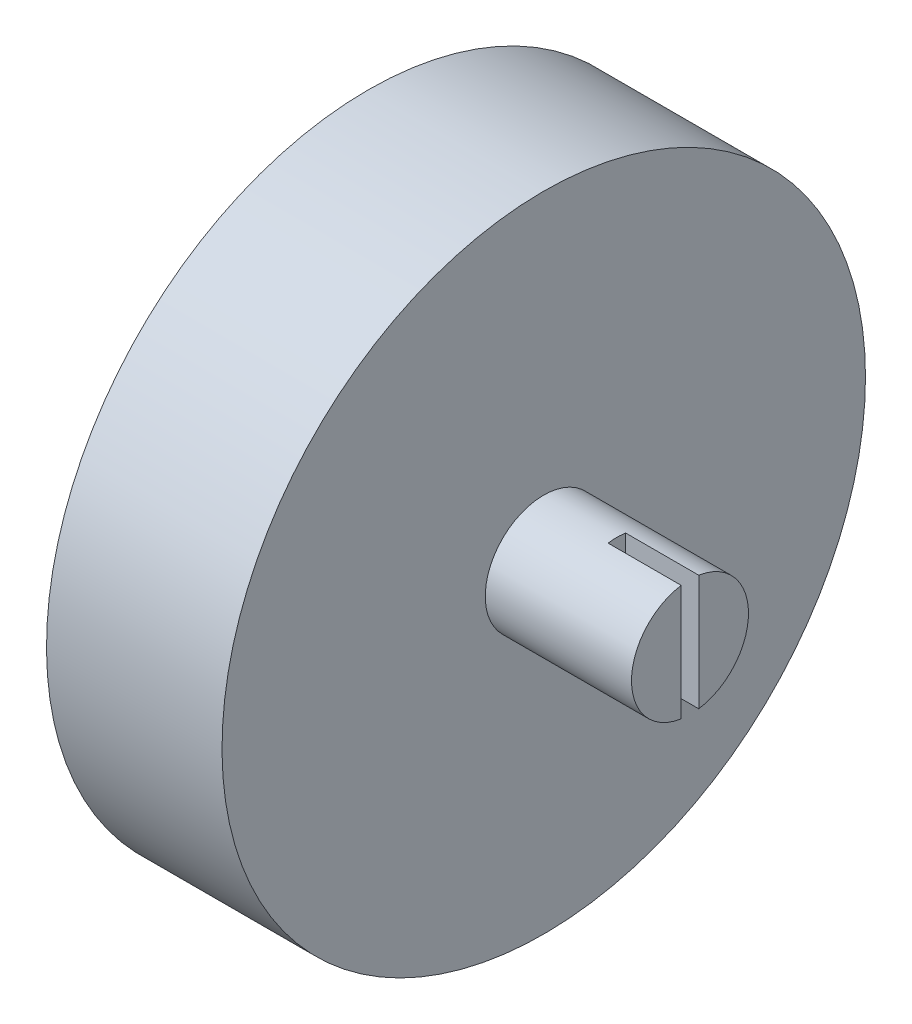
ISO-10303-21;
HEADER;
FILE_DESCRIPTION(('STEP AP214'),'2;1');
FILE_NAME('part.step','',(''),(''),'','','');
FILE_SCHEMA(('AUTOMOTIVE_DESIGN { 1 0 10303 214 1 1 1 1 }'));
ENDSEC;
DATA;
#1=APPLICATION_CONTEXT('core data for automotive mechanical design processes');
#2=APPLICATION_PROTOCOL_DEFINITION('international standard','automotive_design',2000,#1);
#3=PRODUCT_CONTEXT('',#1,'mechanical');
#4=PRODUCT('Part','Part','',(#3));
#5=PRODUCT_RELATED_PRODUCT_CATEGORY('part','',(#4));
#6=PRODUCT_DEFINITION_FORMATION('','',#4);
#7=PRODUCT_DEFINITION_CONTEXT('part definition',#1,'design');
#8=PRODUCT_DEFINITION('design','',#6,#7);
#9=PRODUCT_DEFINITION_SHAPE('','',#8);
#10=(LENGTH_UNIT() NAMED_UNIT(*) SI_UNIT(.MILLI.,.METRE.));
#11=(NAMED_UNIT(*) PLANE_ANGLE_UNIT() SI_UNIT($,.RADIAN.));
#12=(NAMED_UNIT(*) SI_UNIT($,.STERADIAN.) SOLID_ANGLE_UNIT());
#13=UNCERTAINTY_MEASURE_WITH_UNIT(LENGTH_MEASURE(1.E-05),#10,'distance_accuracy_value','');
#14=(GEOMETRIC_REPRESENTATION_CONTEXT(3) GLOBAL_UNCERTAINTY_ASSIGNED_CONTEXT((#13)) GLOBAL_UNIT_ASSIGNED_CONTEXT((#10,
#11,#12)) REPRESENTATION_CONTEXT('',''));
#15=CARTESIAN_POINT('',(0.,0.,0.));
#16=DIRECTION('',(0.,0.,1.));
#17=DIRECTION('',(1.,0.,0.));
#18=AXIS2_PLACEMENT_3D('',#15,#16,#17);
#19=CARTESIAN_POINT('',(5.5,19.5568517413347,6.50000000000001));
#20=DIRECTION('',(0.,0.,-1.));
#21=DIRECTION('',(0.,1.,0.));
#22=AXIS2_PLACEMENT_3D('',#19,#20,#21);
#23=PLANE('',#22);
#24=DIRECTION('',(-1.,0.,0.));
#25=VECTOR('',#24,1.);
#26=CARTESIAN_POINT('',(5.5,-6.94314825866529,6.5));
#27=LINE('',#26,#25);
#28=CARTESIAN_POINT('',(5.5,-6.94314825866529,6.5));
#29=VERTEX_POINT('',#28);
#30=CARTESIAN_POINT('',(4.25,-6.94314825866529,6.5));
#31=VERTEX_POINT('',#30);
#32=EDGE_CURVE('E466',#29,#31,#27,.T.);
#33=ORIENTED_EDGE('',*,*,#32,.T.);
#34=DIRECTION('',(0.,-1.,0.));
#35=VECTOR('',#34,1.);
#36=CARTESIAN_POINT('',(4.25,-5.94314825866529,6.5));
#37=LINE('',#36,#35);
#38=CARTESIAN_POINT('',(4.25,-5.94314825866529,6.5));
#39=VERTEX_POINT('',#38);
#40=EDGE_CURVE('E55',#39,#31,#37,.T.);
#41=ORIENTED_EDGE('',*,*,#40,.F.);
#42=DIRECTION('',(1.,0.,0.));
#43=VECTOR('',#42,1.);
#44=CARTESIAN_POINT('',(0.,-5.94314825866529,6.5));
#45=LINE('',#44,#43);
#46=CARTESIAN_POINT('',(3.,-5.94314825866529,6.5));
#47=VERTEX_POINT('',#46);
#48=EDGE_CURVE('E246',#47,#39,#45,.T.);
#49=ORIENTED_EDGE('',*,*,#48,.F.);
#50=DIRECTION('',(0.,1.,0.));
#51=VECTOR('',#50,1.);
#52=CARTESIAN_POINT('',(3.,19.5568517413347,6.50000000000001));
#53=LINE('',#52,#51);
#54=CARTESIAN_POINT('',(3.,17.1748906632346,6.50000000000001));
#55=VERTEX_POINT('',#54);
#56=EDGE_CURVE('E367',#47,#55,#53,.T.);
#57=ORIENTED_EDGE('',*,*,#56,.T.);
#58=DIRECTION('',(1.,0.,0.));
#59=VECTOR('',#58,1.);
#60=CARTESIAN_POINT('',(5.5,17.1748906632346,6.50000000000001));
#61=LINE('',#60,#59);
#62=CARTESIAN_POINT('',(0.,17.1748906632346,6.5));
#63=VERTEX_POINT('',#62);
#64=EDGE_CURVE('E380',#63,#55,#61,.T.);
#65=ORIENTED_EDGE('',*,*,#64,.F.);
#66=DIRECTION('',(0.,-1.,0.));
#67=VECTOR('',#66,1.);
#68=CARTESIAN_POINT('',(0.,19.5568517413347,6.50000000000001));
#69=LINE('',#68,#67);
#70=CARTESIAN_POINT('',(0.,19.5568517413347,6.50000000000001));
#71=VERTEX_POINT('',#70);
#72=EDGE_CURVE('E390',#71,#63,#69,.T.);
#73=ORIENTED_EDGE('',*,*,#72,.F.);
#74=DIRECTION('',(-1.,0.,0.));
#75=VECTOR('',#74,1.);
#76=CARTESIAN_POINT('',(5.5,19.5568517413347,6.50000000000001));
#77=LINE('',#76,#75);
#78=CARTESIAN_POINT('',(5.5,19.5568517413347,6.50000000000001));
#79=VERTEX_POINT('',#78);
#80=EDGE_CURVE('E462',#79,#71,#77,.T.);
#81=ORIENTED_EDGE('',*,*,#80,.F.);
#82=DIRECTION('',(0.,-1.,0.));
#83=VECTOR('',#82,1.);
#84=CARTESIAN_POINT('',(5.5,19.5568517413347,6.50000000000001));
#85=LINE('',#84,#83);
#86=EDGE_CURVE('E423',#79,#29,#85,.T.);
#87=ORIENTED_EDGE('',*,*,#86,.T.);
#88=EDGE_LOOP('',(#33,#41,#49,#57,#65,#73,#81,#87));
#89=FACE_BOUND('',#88,.T.);
#90=ADVANCED_FACE('F39',(#89),#23,.T.);
#91=CARTESIAN_POINT('',(5.5,-6.94314825866529,6.5));
#92=DIRECTION('',(0.,1.,0.));
#93=DIRECTION('',(0.,0.,1.));
#94=AXIS2_PLACEMENT_3D('',#91,#92,#93);
#95=PLANE('',#94);
#96=DIRECTION('',(0.,0.,1.));
#97=VECTOR('',#96,1.);
#98=CARTESIAN_POINT('',(3.,-6.9431482586653,9.00000000000001));
#99=LINE('',#98,#97);
#100=CARTESIAN_POINT('',(3.,-6.9431482586653,6.5));
#101=VERTEX_POINT('',#100);
#102=CARTESIAN_POINT('',(3.,-6.9431482586653,9.00000000000001));
#103=VERTEX_POINT('',#102);
#104=EDGE_CURVE('E336',#101,#103,#99,.T.);
#105=ORIENTED_EDGE('',*,*,#104,.F.);
#106=DIRECTION('',(1.,0.,0.));
#107=VECTOR('',#106,1.);
#108=CARTESIAN_POINT('',(0.,-6.94314825866529,6.5));
#109=LINE('',#108,#107);
#110=CARTESIAN_POINT('',(0.,-6.94314825866529,6.5));
#111=VERTEX_POINT('',#110);
#112=EDGE_CURVE('E693',#111,#101,#109,.T.);
#113=ORIENTED_EDGE('',*,*,#112,.F.);
#114=DIRECTION('',(0.,0.,-1.));
#115=VECTOR('',#114,1.);
#116=CARTESIAN_POINT('',(0.,-6.94314825866529,6.5));
#117=LINE('',#116,#115);
#118=CARTESIAN_POINT('',(0.,-6.9431482586653,9.00000000000001));
#119=VERTEX_POINT('',#118);
#120=EDGE_CURVE('E262',#119,#111,#117,.T.);
#121=ORIENTED_EDGE('',*,*,#120,.F.);
#122=DIRECTION('',(-1.,0.,0.));
#123=VECTOR('',#122,1.);
#124=CARTESIAN_POINT('',(3.,-6.9431482586653,9.00000000000001));
#125=LINE('',#124,#123);
#126=EDGE_CURVE('E371',#103,#119,#125,.T.);
#127=ORIENTED_EDGE('',*,*,#126,.F.);
#128=EDGE_LOOP('',(#105,#113,#121,#127));
#129=FACE_BOUND('',#128,.T.);
#130=ADVANCED_FACE('F628',(#129),#95,.T.);
#131=DIRECTION('',(-1.,0.,0.));
#132=VECTOR('',#131,1.);
#133=CARTESIAN_POINT('',(5.5,-6.94314825866529,4.76239289224447));
#134=LINE('',#133,#132);
#135=CARTESIAN_POINT('',(5.5,-6.94314825866529,4.76239289224447));
#136=VERTEX_POINT('',#135);
#137=CARTESIAN_POINT('',(4.25,-6.94314825866529,4.76239289224447));
#138=VERTEX_POINT('',#137);
#139=EDGE_CURVE('E469',#136,#138,#134,.T.);
#140=ORIENTED_EDGE('',*,*,#139,.T.);
#141=DIRECTION('',(0.,0.,-1.));
#142=VECTOR('',#141,1.);
#143=CARTESIAN_POINT('',(4.25,-6.94314825866529,4.76239289224447));
#144=LINE('',#143,#142);
#145=EDGE_CURVE('E63',#31,#138,#144,.T.);
#146=ORIENTED_EDGE('',*,*,#145,.F.);
#147=ORIENTED_EDGE('',*,*,#32,.F.);
#148=DIRECTION('',(0.,0.,-1.));
#149=VECTOR('',#148,1.);
#150=CARTESIAN_POINT('',(5.5,-6.94314825866529,6.5));
#151=LINE('',#150,#149);
#152=EDGE_CURVE('E420',#29,#136,#151,.T.);
#153=ORIENTED_EDGE('',*,*,#152,.T.);
#154=EDGE_LOOP('',(#140,#146,#147,#153));
#155=FACE_BOUND('',#154,.T.);
#156=ADVANCED_FACE('F633',(#155),#95,.T.);
#157=CARTESIAN_POINT('',(5.5,-6.94314825866529,-6.5));
#158=DIRECTION('',(0.,-1.,0.));
#159=DIRECTION('',(0.,0.,-1.));
#160=AXIS2_PLACEMENT_3D('',#157,#158,#159);
#161=PLANE('',#160);
#162=DIRECTION('',(0.,0.,-1.));
#163=VECTOR('',#162,1.);
#164=CARTESIAN_POINT('',(4.,-6.94314825866529,-6.51239289224447));
#165=LINE('',#164,#163);
#166=CARTESIAN_POINT('',(4.,-6.94314825866529,-4.76239289224447));
#167=VERTEX_POINT('',#166);
#168=CARTESIAN_POINT('',(4.,-6.94314825866529,-6.5));
#169=VERTEX_POINT('',#168);
#170=EDGE_CURVE('E264',#167,#169,#165,.T.);
#171=ORIENTED_EDGE('',*,*,#170,.F.);
#172=DIRECTION('',(-1.,0.,0.));
#173=VECTOR('',#172,1.);
#174=CARTESIAN_POINT('',(5.5,-6.94314825866529,-4.76239289224447));
#175=LINE('',#174,#173);
#176=CARTESIAN_POINT('',(5.5,-6.94314825866529,-4.76239289224447));
#177=VERTEX_POINT('',#176);
#178=EDGE_CURVE('E491',#177,#167,#175,.T.);
#179=ORIENTED_EDGE('',*,*,#178,.F.);
#180=DIRECTION('',(0.,0.,1.));
#181=VECTOR('',#180,1.);
#182=CARTESIAN_POINT('',(5.5,-6.94314825866529,-6.5));
#183=LINE('',#182,#181);
#184=CARTESIAN_POINT('',(5.5,-6.94314825866529,-6.5));
#185=VERTEX_POINT('',#184);
#186=EDGE_CURVE('E394',#185,#177,#183,.T.);
#187=ORIENTED_EDGE('',*,*,#186,.F.);
#188=DIRECTION('',(-1.,0.,0.));
#189=VECTOR('',#188,1.);
#190=CARTESIAN_POINT('',(5.5,-6.94314825866529,-6.5));
#191=LINE('',#190,#189);
#192=EDGE_CURVE('E495',#185,#169,#191,.T.);
#193=ORIENTED_EDGE('',*,*,#192,.T.);
#194=EDGE_LOOP('',(#171,#179,#187,#193));
#195=FACE_BOUND('',#194,.T.);
#196=ADVANCED_FACE('F563',(#195),#161,.F.);
#197=DIRECTION('',(-1.,0.,0.));
#198=VECTOR('',#197,1.);
#199=CARTESIAN_POINT('',(0.,-6.94314825866529,-6.51239289224447));
#200=LINE('',#199,#198);
#201=CARTESIAN_POINT('',(3.,-6.94314825866529,-6.51239289224447));
#202=VERTEX_POINT('',#201);
#203=CARTESIAN_POINT('',(0.,-6.94314825866529,-6.51239289224447));
#204=VERTEX_POINT('',#203);
#205=EDGE_CURVE('E268',#202,#204,#200,.T.);
#206=ORIENTED_EDGE('',*,*,#205,.F.);
#207=CARTESIAN_POINT('',(3.,-6.9431482586653,-9.));
#208=VERTEX_POINT('',#207);
#209=EDGE_CURVE('E338',#208,#202,#99,.T.);
#210=ORIENTED_EDGE('',*,*,#209,.F.);
#211=DIRECTION('',(-1.,0.,0.));
#212=VECTOR('',#211,1.);
#213=CARTESIAN_POINT('',(3.,-6.9431482586653,-9.));
#214=LINE('',#213,#212);
#215=CARTESIAN_POINT('',(0.,-6.9431482586653,-9.));
#216=VERTEX_POINT('',#215);
#217=EDGE_CURVE('E351',#208,#216,#214,.T.);
#218=ORIENTED_EDGE('',*,*,#217,.T.);
#219=DIRECTION('',(0.,0.,1.));
#220=VECTOR('',#219,1.);
#221=CARTESIAN_POINT('',(0.,-6.94314825866529,-6.5));
#222=LINE('',#221,#220);
#223=EDGE_CURVE('E433',#216,#204,#222,.T.);
#224=ORIENTED_EDGE('',*,*,#223,.T.);
#225=EDGE_LOOP('',(#206,#210,#218,#224));
#226=FACE_BOUND('',#225,.T.);
#227=ADVANCED_FACE('F545',(#226),#161,.F.);
#228=CARTESIAN_POINT('',(5.5,19.5568517413347,-6.49999999999999));
#229=DIRECTION('',(0.,0.,-1.));
#230=DIRECTION('',(0.,1.,0.));
#231=AXIS2_PLACEMENT_3D('',#228,#229,#230);
#232=PLANE('',#231);
#233=DIRECTION('',(0.,1.,0.));
#234=VECTOR('',#233,1.);
#235=CARTESIAN_POINT('',(4.,19.5568517413347,-6.49999999999999));
#236=LINE('',#235,#234);
#237=CARTESIAN_POINT('',(4.,-5.94314825866529,-6.5));
#238=VERTEX_POINT('',#237);
#239=EDGE_CURVE('E11',#169,#238,#236,.T.);
#240=ORIENTED_EDGE('',*,*,#239,.F.);
#241=ORIENTED_EDGE('',*,*,#192,.F.);
#242=DIRECTION('',(0.,-1.,0.));
#243=VECTOR('',#242,1.);
#244=CARTESIAN_POINT('',(5.5,19.5568517413347,-6.49999999999999));
#245=LINE('',#244,#243);
#246=CARTESIAN_POINT('',(5.5,19.5568517413347,-6.49999999999999));
#247=VERTEX_POINT('',#246);
#248=EDGE_CURVE('E389',#247,#185,#245,.T.);
#249=ORIENTED_EDGE('',*,*,#248,.F.);
#250=DIRECTION('',(-1.,0.,0.));
#251=VECTOR('',#250,1.);
#252=CARTESIAN_POINT('',(5.5,19.5568517413347,-6.49999999999999));
#253=LINE('',#252,#251);
#254=CARTESIAN_POINT('',(0.,19.5568517413347,-6.49999999999999));
#255=VERTEX_POINT('',#254);
#256=EDGE_CURVE('E426',#247,#255,#253,.T.);
#257=ORIENTED_EDGE('',*,*,#256,.T.);
#258=DIRECTION('',(0.,-1.,0.));
#259=VECTOR('',#258,1.);
#260=CARTESIAN_POINT('',(0.,19.5568517413347,-6.49999999999999));
#261=LINE('',#260,#259);
#262=CARTESIAN_POINT('',(0.,17.1748906632345,-6.5));
#263=VERTEX_POINT('',#262);
#264=EDGE_CURVE('E429',#255,#263,#261,.T.);
#265=ORIENTED_EDGE('',*,*,#264,.T.);
#266=DIRECTION('',(1.,0.,0.));
#267=VECTOR('',#266,1.);
#268=CARTESIAN_POINT('',(5.5,17.1748906632345,-6.49999999999999));
#269=LINE('',#268,#267);
#270=CARTESIAN_POINT('',(3.,17.1748906632345,-6.5));
#271=VERTEX_POINT('',#270);
#272=EDGE_CURVE('E331',#263,#271,#269,.T.);
#273=ORIENTED_EDGE('',*,*,#272,.T.);
#274=DIRECTION('',(0.,1.,0.));
#275=VECTOR('',#274,1.);
#276=CARTESIAN_POINT('',(3.,19.5568517413347,-6.49999999999999));
#277=LINE('',#276,#275);
#278=CARTESIAN_POINT('',(3.,-5.94314825866529,-6.5));
#279=VERTEX_POINT('',#278);
#280=EDGE_CURVE('E512',#279,#271,#277,.T.);
#281=ORIENTED_EDGE('',*,*,#280,.F.);
#282=DIRECTION('',(-1.,0.,0.));
#283=VECTOR('',#282,1.);
#284=CARTESIAN_POINT('',(5.5,-5.94314825866529,-6.5));
#285=LINE('',#284,#283);
#286=EDGE_CURVE('E298',#238,#279,#285,.T.);
#287=ORIENTED_EDGE('',*,*,#286,.F.);
#288=EDGE_LOOP('',(#240,#241,#249,#257,#265,#273,#281,#287));
#289=FACE_BOUND('',#288,.T.);
#290=ADVANCED_FACE('F567',(#289),#232,.F.);
#291=CARTESIAN_POINT('',(3.,0.,0.));
#292=DIRECTION('',(-1.,0.,0.));
#293=DIRECTION('',(0.,0.,1.));
#294=AXIS2_PLACEMENT_3D('',#291,#292,#293);
#295=PLANE('',#294);
#296=ORIENTED_EDGE('',*,*,#209,.T.);
#297=DIRECTION('',(0.,1.,0.));
#298=VECTOR('',#297,1.);
#299=CARTESIAN_POINT('',(3.,0.,-6.51239289224447));
#300=LINE('',#299,#298);
#301=CARTESIAN_POINT('',(3.,-5.94314825866529,-6.51239289224447));
#302=VERTEX_POINT('',#301);
#303=EDGE_CURVE('E48',#202,#302,#300,.T.);
#304=ORIENTED_EDGE('',*,*,#303,.T.);
#305=DIRECTION('',(0.,0.,1.));
#306=VECTOR('',#305,1.);
#307=CARTESIAN_POINT('',(3.,-5.94314825866529,0.));
#308=LINE('',#307,#306);
#309=EDGE_CURVE('E530',#302,#279,#308,.T.);
#310=ORIENTED_EDGE('',*,*,#309,.T.);
#311=ORIENTED_EDGE('',*,*,#280,.T.);
#312=DIRECTION('',(0.,0.,-1.));
#313=VECTOR('',#312,1.);
#314=CARTESIAN_POINT('',(3.,17.1748906632346,9.));
#315=LINE('',#314,#313);
#316=CARTESIAN_POINT('',(3.,17.1748906632345,-9.00000000000001));
#317=VERTEX_POINT('',#316);
#318=EDGE_CURVE('E346',#271,#317,#315,.T.);
#319=ORIENTED_EDGE('',*,*,#318,.T.);
#320=DIRECTION('',(0.,-1.,0.));
#321=VECTOR('',#320,1.);
#322=CARTESIAN_POINT('',(3.,-6.9431482586653,-9.));
#323=LINE('',#322,#321);
#324=EDGE_CURVE('E332',#317,#208,#323,.T.);
#325=ORIENTED_EDGE('',*,*,#324,.T.);
#326=EDGE_LOOP('',(#296,#304,#310,#311,#319,#325));
#327=FACE_BOUND('',#326,.T.);
#328=ADVANCED_FACE('F536',(#327),#295,.T.);
#329=CARTESIAN_POINT('',(22.,0.,0.));
#330=DIRECTION('',(-1.,0.,0.));
#331=DIRECTION('',(0.,0.,1.));
#332=AXIS2_PLACEMENT_3D('',#329,#330,#331);
#333=CYLINDRICAL_SURFACE('',#332,4.);
#334=CARTESIAN_POINT('',(12.,0.,0.));
#335=DIRECTION('',(1.,0.,0.));
#336=DIRECTION('',(0.,0.,-1.));
#337=AXIS2_PLACEMENT_3D('',#334,#335,#336);
#338=CIRCLE('',#337,4.);
#339=CARTESIAN_POINT('',(12.,0.,-4.));
#340=VERTEX_POINT('',#339);
#341=EDGE_CURVE('E326',#340,#340,#338,.T.);
#342=ORIENTED_EDGE('',*,*,#341,.T.);
#343=EDGE_LOOP('',(#342));
#344=FACE_BOUND('',#343,.T.);
#345=DIRECTION('',(-1.,0.,0.));
#346=VECTOR('',#345,1.);
#347=CARTESIAN_POINT('',(22.,3.95474398665704,-0.6));
#348=LINE('',#347,#346);
#349=CARTESIAN_POINT('',(22.,3.95474398665704,-0.6));
#350=VERTEX_POINT('',#349);
#351=CARTESIAN_POINT('',(17.,3.95474398665704,-0.6));
#352=VERTEX_POINT('',#351);
#353=EDGE_CURVE('E318',#350,#352,#348,.T.);
#354=ORIENTED_EDGE('',*,*,#353,.F.);
#355=CARTESIAN_POINT('',(22.,0.,0.));
#356=DIRECTION('',(1.,0.,0.));
#357=DIRECTION('',(0.,0.,-1.));
#358=AXIS2_PLACEMENT_3D('',#355,#356,#357);
#359=CIRCLE('',#358,4.);
#360=CARTESIAN_POINT('',(22.,-3.95474398665704,-0.6));
#361=VERTEX_POINT('',#360);
#362=EDGE_CURVE('E321',#361,#350,#359,.T.);
#363=ORIENTED_EDGE('',*,*,#362,.F.);
#364=DIRECTION('',(-1.,0.,0.));
#365=VECTOR('',#364,1.);
#366=CARTESIAN_POINT('',(22.,-3.95474398665704,-0.6));
#367=LINE('',#366,#365);
#368=CARTESIAN_POINT('',(17.,-3.95474398665704,-0.6));
#369=VERTEX_POINT('',#368);
#370=EDGE_CURVE('E315',#369,#361,#367,.F.);
#371=ORIENTED_EDGE('',*,*,#370,.F.);
#372=CARTESIAN_POINT('',(17.,0.,0.));
#373=DIRECTION('',(-1.,0.,0.));
#374=DIRECTION('',(0.,0.,1.));
#375=AXIS2_PLACEMENT_3D('',#372,#373,#374);
#376=CIRCLE('',#375,4.);
#377=CARTESIAN_POINT('',(17.,-3.95474398665704,0.6));
#378=VERTEX_POINT('',#377);
#379=EDGE_CURVE('E525',#369,#378,#376,.T.);
#380=ORIENTED_EDGE('',*,*,#379,.T.);
#381=DIRECTION('',(-1.,0.,0.));
#382=VECTOR('',#381,1.);
#383=CARTESIAN_POINT('',(22.,-3.95474398665704,0.6));
#384=LINE('',#383,#382);
#385=CARTESIAN_POINT('',(22.,-3.95474398665704,0.6));
#386=VERTEX_POINT('',#385);
#387=EDGE_CURVE('E312',#386,#378,#384,.T.);
#388=ORIENTED_EDGE('',*,*,#387,.F.);
#389=CARTESIAN_POINT('',(22.,3.95474398665704,0.600000000000001));
#390=VERTEX_POINT('',#389);
#391=EDGE_CURVE('E325',#390,#386,#359,.T.);
#392=ORIENTED_EDGE('',*,*,#391,.F.);
#393=DIRECTION('',(-1.,0.,0.));
#394=VECTOR('',#393,1.);
#395=CARTESIAN_POINT('',(22.,3.95474398665704,0.600000000000001));
#396=LINE('',#395,#394);
#397=CARTESIAN_POINT('',(17.,3.95474398665704,0.600000000000001));
#398=VERTEX_POINT('',#397);
#399=EDGE_CURVE('E309',#398,#390,#396,.F.);
#400=ORIENTED_EDGE('',*,*,#399,.F.);
#401=EDGE_CURVE('E529',#398,#352,#376,.T.);
#402=ORIENTED_EDGE('',*,*,#401,.T.);
#403=EDGE_LOOP('',(#354,#363,#371,#380,#388,#392,#400,#402));
#404=FACE_BOUND('',#403,.T.);
#405=ADVANCED_FACE('F586',(#344,#404),#333,.T.);
#406=CARTESIAN_POINT('',(22.,0.,0.));
#407=DIRECTION('',(1.,0.,0.));
#408=DIRECTION('',(0.,0.,-1.));
#409=AXIS2_PLACEMENT_3D('',#406,#407,#408);
#410=PLANE('',#409);
#411=ORIENTED_EDGE('',*,*,#362,.T.);
#412=DIRECTION('',(0.,-1.,0.));
#413=VECTOR('',#412,1.);
#414=CARTESIAN_POINT('',(22.,0.,-0.6));
#415=LINE('',#414,#413);
#416=EDGE_CURVE('E521',#350,#361,#415,.T.);
#417=ORIENTED_EDGE('',*,*,#416,.T.);
#418=EDGE_LOOP('',(#411,#417));
#419=FACE_BOUND('',#418,.T.);
#420=ADVANCED_FACE('F752',(#419),#410,.T.);
#421=ORIENTED_EDGE('',*,*,#391,.T.);
#422=DIRECTION('',(0.,1.,0.));
#423=VECTOR('',#422,1.);
#424=CARTESIAN_POINT('',(22.,0.,0.6));
#425=LINE('',#424,#423);
#426=EDGE_CURVE('E330',#386,#390,#425,.T.);
#427=ORIENTED_EDGE('',*,*,#426,.T.);
#428=EDGE_LOOP('',(#421,#427));
#429=FACE_BOUND('',#428,.T.);
#430=ADVANCED_FACE('F581',(#429),#410,.T.);
#431=CARTESIAN_POINT('',(12.,0.,0.));
#432=DIRECTION('',(-1.,0.,0.));
#433=DIRECTION('',(0.,0.,1.));
#434=AXIS2_PLACEMENT_3D('',#431,#432,#433);
#435=CYLINDRICAL_SURFACE('',#434,22.);
#436=CARTESIAN_POINT('',(0.,0.,0.));
#437=DIRECTION('',(1.,0.,0.));
#438=DIRECTION('',(0.,0.,-1.));
#439=AXIS2_PLACEMENT_3D('',#436,#437,#438);
#440=CIRCLE('',#439,22.);
#441=CARTESIAN_POINT('',(0.,-21.837327130716,-2.67042015160433));
#442=VERTEX_POINT('',#441);
#443=CARTESIAN_POINT('',(0.,-21.837327130716,2.67042015160434));
#444=VERTEX_POINT('',#443);
#445=EDGE_CURVE('E465',#442,#444,#440,.T.);
#446=ORIENTED_EDGE('',*,*,#445,.T.);
#447=DIRECTION('',(-1.,0.,0.));
#448=VECTOR('',#447,1.);
#449=CARTESIAN_POINT('',(5.5,-21.837327130716,2.67042015160434));
#450=LINE('',#449,#448);
#451=CARTESIAN_POINT('',(5.5,-21.837327130716,2.67042015160434));
#452=VERTEX_POINT('',#451);
#453=EDGE_CURVE('E478',#452,#444,#450,.T.);
#454=ORIENTED_EDGE('',*,*,#453,.F.);
#455=CARTESIAN_POINT('',(5.5,0.,0.));
#456=DIRECTION('',(1.,0.,0.));
#457=DIRECTION('',(0.,0.,-1.));
#458=AXIS2_PLACEMENT_3D('',#455,#456,#457);
#459=CIRCLE('',#458,22.);
#460=CARTESIAN_POINT('',(5.5,-21.837327130716,-2.67042015160433));
#461=VERTEX_POINT('',#460);
#462=EDGE_CURVE('E506',#452,#461,#459,.T.);
#463=ORIENTED_EDGE('',*,*,#462,.T.);
#464=DIRECTION('',(-1.,0.,0.));
#465=VECTOR('',#464,1.);
#466=CARTESIAN_POINT('',(5.5,-21.837327130716,-2.67042015160433));
#467=LINE('',#466,#465);
#468=EDGE_CURVE('E481',#461,#442,#467,.T.);
#469=ORIENTED_EDGE('',*,*,#468,.T.);
#470=EDGE_LOOP('',(#446,#454,#463,#469));
#471=FACE_BOUND('',#470,.T.);
#472=CARTESIAN_POINT('',(12.,0.,0.));
#473=DIRECTION('',(1.,0.,0.));
#474=DIRECTION('',(0.,0.,-1.));
#475=AXIS2_PLACEMENT_3D('',#472,#473,#474);
#476=CIRCLE('',#475,22.);
#477=CARTESIAN_POINT('',(12.,0.,-22.));
#478=VERTEX_POINT('',#477);
#479=EDGE_CURVE('E502',#478,#478,#476,.T.);
#480=ORIENTED_EDGE('',*,*,#479,.F.);
#481=EDGE_LOOP('',(#480));
#482=FACE_BOUND('',#481,.T.);
#483=ADVANCED_FACE('F41',(#471,#482),#435,.T.);
#484=CARTESIAN_POINT('',(12.,0.,0.));
#485=DIRECTION('',(1.,0.,0.));
#486=DIRECTION('',(0.,0.,-1.));
#487=AXIS2_PLACEMENT_3D('',#484,#485,#486);
#488=PLANE('',#487);
#489=ORIENTED_EDGE('',*,*,#341,.F.);
#490=EDGE_LOOP('',(#489));
#491=FACE_BOUND('',#490,.T.);
#492=ORIENTED_EDGE('',*,*,#479,.T.);
#493=EDGE_LOOP('',(#492));
#494=FACE_BOUND('',#493,.T.);
#495=ADVANCED_FACE('F665',(#491,#494),#488,.T.);
#496=CARTESIAN_POINT('',(0.,0.,0.));
#497=DIRECTION('',(1.,0.,0.));
#498=DIRECTION('',(0.,0.,-1.));
#499=AXIS2_PLACEMENT_3D('',#496,#497,#498);
#500=PLANE('',#499);
#501=CARTESIAN_POINT('',(0.,0.,14.));
#502=DIRECTION('',(1.,0.,0.));
#503=DIRECTION('',(0.,0.,-1.));
#504=AXIS2_PLACEMENT_3D('',#501,#502,#503);
#505=CIRCLE('',#504,1.5);
#506=CARTESIAN_POINT('',(0.,0.,12.5));
#507=VERTEX_POINT('',#506);
#508=EDGE_CURVE('E676',#507,#507,#505,.T.);
#509=ORIENTED_EDGE('',*,*,#508,.T.);
#510=EDGE_LOOP('',(#509));
#511=FACE_BOUND('',#510,.T.);
#512=CARTESIAN_POINT('',(0.,0.,-14.));
#513=DIRECTION('',(1.,0.,0.));
#514=DIRECTION('',(0.,0.,-1.));
#515=AXIS2_PLACEMENT_3D('',#512,#513,#514);
#516=CIRCLE('',#515,1.5);
#517=CARTESIAN_POINT('',(0.,0.,-15.5));
#518=VERTEX_POINT('',#517);
#519=EDGE_CURVE('E679',#518,#518,#516,.T.);
#520=ORIENTED_EDGE('',*,*,#519,.T.);
#521=EDGE_LOOP('',(#520));
#522=FACE_BOUND('',#521,.T.);
#523=ORIENTED_EDGE('',*,*,#72,.T.);
#524=DIRECTION('',(0.,0.,-1.));
#525=VECTOR('',#524,1.);
#526=CARTESIAN_POINT('',(0.,17.1748906632346,9.));
#527=LINE('',#526,#525);
#528=CARTESIAN_POINT('',(0.,17.1748906632346,9.));
#529=VERTEX_POINT('',#528);
#530=EDGE_CURVE('E337',#529,#63,#527,.T.);
#531=ORIENTED_EDGE('',*,*,#530,.F.);
#532=DIRECTION('',(0.,1.,0.));
#533=VECTOR('',#532,1.);
#534=CARTESIAN_POINT('',(0.,17.1748906632346,9.));
#535=LINE('',#534,#533);
#536=EDGE_CURVE('E356',#119,#529,#535,.T.);
#537=ORIENTED_EDGE('',*,*,#536,.F.);
#538=ORIENTED_EDGE('',*,*,#120,.T.);
#539=DIRECTION('',(0.,-1.,0.));
#540=VECTOR('',#539,1.);
#541=CARTESIAN_POINT('',(0.,-5.94314825866529,6.5));
#542=LINE('',#541,#540);
#543=CARTESIAN_POINT('',(0.,-5.94314825866529,6.5));
#544=VERTEX_POINT('',#543);
#545=EDGE_CURVE('E241',#544,#111,#542,.T.);
#546=ORIENTED_EDGE('',*,*,#545,.F.);
#547=DIRECTION('',(0.,0.,1.));
#548=VECTOR('',#547,1.);
#549=CARTESIAN_POINT('',(0.,-5.94314825866529,4.76239289224447));
#550=LINE('',#549,#548);
#551=CARTESIAN_POINT('',(0.,-5.94314825866529,4.76239289224447));
#552=VERTEX_POINT('',#551);
#553=EDGE_CURVE('E250',#552,#544,#550,.T.);
#554=ORIENTED_EDGE('',*,*,#553,.F.);
#555=DIRECTION('',(0.,1.,0.));
#556=VECTOR('',#555,1.);
#557=CARTESIAN_POINT('',(0.,-10.,4.76239289224447));
#558=LINE('',#557,#556);
#559=CARTESIAN_POINT('',(0.,-10.,4.76239289224447));
#560=VERTEX_POINT('',#559);
#561=EDGE_CURVE('E455',#560,#552,#558,.T.);
#562=ORIENTED_EDGE('',*,*,#561,.F.);
#563=DIRECTION('',(0.,-0.952328688194239,-0.305073875712489));
#564=VECTOR('',#563,1.);
#565=CARTESIAN_POINT('',(0.,-10.,4.76239289224447));
#566=LINE('',#565,#564);
#567=CARTESIAN_POINT('',(0.,-16.5303712131336,2.67042015160433));
#568=VERTEX_POINT('',#567);
#569=EDGE_CURVE('E451',#560,#568,#566,.T.);
#570=ORIENTED_EDGE('',*,*,#569,.T.);
#571=DIRECTION('',(0.,1.,0.));
#572=VECTOR('',#571,1.);
#573=CARTESIAN_POINT('',(0.,-16.8581606699215,2.67042015160433));
#574=LINE('',#573,#572);
#575=EDGE_CURVE('E447',#444,#568,#574,.T.);
#576=ORIENTED_EDGE('',*,*,#575,.F.);
#577=ORIENTED_EDGE('',*,*,#445,.F.);
#578=DIRECTION('',(0.,-1.,0.));
#579=VECTOR('',#578,1.);
#580=CARTESIAN_POINT('',(0.,-16.8581606699215,-2.67042015160433));
#581=LINE('',#580,#579);
#582=CARTESIAN_POINT('',(0.,-16.5303712131336,-2.67042015160434));
#583=VERTEX_POINT('',#582);
#584=EDGE_CURVE('E444',#583,#442,#581,.T.);
#585=ORIENTED_EDGE('',*,*,#584,.F.);
#586=DIRECTION('',(0.,-0.95232868819424,0.305073875712488));
#587=VECTOR('',#586,1.);
#588=CARTESIAN_POINT('',(0.,-10.,-4.76239289224447));
#589=LINE('',#588,#587);
#590=CARTESIAN_POINT('',(0.,-10.,-4.76239289224447));
#591=VERTEX_POINT('',#590);
#592=EDGE_CURVE('E440',#591,#583,#589,.T.);
#593=ORIENTED_EDGE('',*,*,#592,.F.);
#594=DIRECTION('',(0.,1.,0.));
#595=VECTOR('',#594,1.);
#596=CARTESIAN_POINT('',(0.,-10.,-4.76239289224447));
#597=LINE('',#596,#595);
#598=CARTESIAN_POINT('',(0.,-5.94314825866529,-4.76239289224447));
#599=VERTEX_POINT('',#598);
#600=EDGE_CURVE('E437',#591,#599,#597,.T.);
#601=ORIENTED_EDGE('',*,*,#600,.T.);
#602=DIRECTION('',(0.,0.,1.));
#603=VECTOR('',#602,1.);
#604=CARTESIAN_POINT('',(0.,-5.94314825866529,-4.76239289224447));
#605=LINE('',#604,#603);
#606=CARTESIAN_POINT('',(0.,-5.94314825866529,-6.51239289224447));
#607=VERTEX_POINT('',#606);
#608=EDGE_CURVE('E285',#607,#599,#605,.T.);
#609=ORIENTED_EDGE('',*,*,#608,.F.);
#610=DIRECTION('',(0.,-1.,0.));
#611=VECTOR('',#610,1.);
#612=CARTESIAN_POINT('',(0.,-5.94314825866529,-6.51239289224447));
#613=LINE('',#612,#611);
#614=EDGE_CURVE('E288',#607,#204,#613,.T.);
#615=ORIENTED_EDGE('',*,*,#614,.T.);
#616=ORIENTED_EDGE('',*,*,#223,.F.);
#617=DIRECTION('',(0.,-1.,0.));
#618=VECTOR('',#617,1.);
#619=CARTESIAN_POINT('',(0.,-6.9431482586653,-9.));
#620=LINE('',#619,#618);
#621=CARTESIAN_POINT('',(0.,17.1748906632345,-9.00000000000001));
#622=VERTEX_POINT('',#621);
#623=EDGE_CURVE('E352',#622,#216,#620,.T.);
#624=ORIENTED_EDGE('',*,*,#623,.F.);
#625=EDGE_CURVE('E360',#263,#622,#527,.T.);
#626=ORIENTED_EDGE('',*,*,#625,.F.);
#627=ORIENTED_EDGE('',*,*,#264,.F.);
#628=DIRECTION('',(0.,0.,-1.));
#629=VECTOR('',#628,1.);
#630=CARTESIAN_POINT('',(0.,19.5568517413347,6.50000000000001));
#631=LINE('',#630,#629);
#632=EDGE_CURVE('E384',#71,#255,#631,.T.);
#633=ORIENTED_EDGE('',*,*,#632,.F.);
#634=EDGE_LOOP('',(#523,#531,#537,#538,#546,#554,#562,#570,#576,#577,#585,#593,#601,#609,#615,
#616,#624,#626,#627,#633));
#635=FACE_BOUND('',#634,.T.);
#636=ADVANCED_FACE('F260',(#511,#522,#635),#500,.F.);
#637=CARTESIAN_POINT('',(5.5,0.,0.));
#638=DIRECTION('',(1.,0.,0.));
#639=DIRECTION('',(0.,0.,-1.));
#640=AXIS2_PLACEMENT_3D('',#637,#638,#639);
#641=PLANE('',#640);
#642=ORIENTED_EDGE('',*,*,#462,.F.);
#643=DIRECTION('',(0.,-1.,0.));
#644=VECTOR('',#643,1.);
#645=CARTESIAN_POINT('',(5.5,-16.8581606699215,2.67042015160433));
#646=LINE('',#645,#644);
#647=CARTESIAN_POINT('',(5.5,-16.5303712131336,2.67042015160433));
#648=VERTEX_POINT('',#647);
#649=EDGE_CURVE('E408',#648,#452,#646,.T.);
#650=ORIENTED_EDGE('',*,*,#649,.F.);
#651=DIRECTION('',(0.,-0.952328688194239,-0.305073875712489));
#652=VECTOR('',#651,1.);
#653=CARTESIAN_POINT('',(5.5,-10.,4.76239289224447));
#654=LINE('',#653,#652);
#655=CARTESIAN_POINT('',(5.5,-10.,4.76239289224447));
#656=VERTEX_POINT('',#655);
#657=EDGE_CURVE('E412',#656,#648,#654,.T.);
#658=ORIENTED_EDGE('',*,*,#657,.F.);
#659=DIRECTION('',(0.,1.,0.));
#660=VECTOR('',#659,1.);
#661=CARTESIAN_POINT('',(5.5,-10.,4.76239289224447));
#662=LINE('',#661,#660);
#663=EDGE_CURVE('E416',#656,#136,#662,.T.);
#664=ORIENTED_EDGE('',*,*,#663,.T.);
#665=ORIENTED_EDGE('',*,*,#152,.F.);
#666=ORIENTED_EDGE('',*,*,#86,.F.);
#667=DIRECTION('',(0.,0.,-1.));
#668=VECTOR('',#667,1.);
#669=CARTESIAN_POINT('',(5.5,19.5568517413347,6.50000000000001));
#670=LINE('',#669,#668);
#671=EDGE_CURVE('E385',#79,#247,#670,.T.);
#672=ORIENTED_EDGE('',*,*,#671,.T.);
#673=ORIENTED_EDGE('',*,*,#248,.T.);
#674=ORIENTED_EDGE('',*,*,#186,.T.);
#675=DIRECTION('',(0.,1.,0.));
#676=VECTOR('',#675,1.);
#677=CARTESIAN_POINT('',(5.5,-10.,-4.76239289224447));
#678=LINE('',#677,#676);
#679=CARTESIAN_POINT('',(5.5,-10.,-4.76239289224447));
#680=VERTEX_POINT('',#679);
#681=EDGE_CURVE('E398',#680,#177,#678,.T.);
#682=ORIENTED_EDGE('',*,*,#681,.F.);
#683=DIRECTION('',(0.,-0.95232868819424,0.305073875712488));
#684=VECTOR('',#683,1.);
#685=CARTESIAN_POINT('',(5.5,-10.,-4.76239289224447));
#686=LINE('',#685,#684);
#687=CARTESIAN_POINT('',(5.5,-16.5303712131336,-2.67042015160434));
#688=VERTEX_POINT('',#687);
#689=EDGE_CURVE('E401',#680,#688,#686,.T.);
#690=ORIENTED_EDGE('',*,*,#689,.T.);
#691=DIRECTION('',(0.,1.,0.));
#692=VECTOR('',#691,1.);
#693=CARTESIAN_POINT('',(5.5,-16.8581606699215,-2.67042015160433));
#694=LINE('',#693,#692);
#695=EDGE_CURVE('E405',#461,#688,#694,.T.);
#696=ORIENTED_EDGE('',*,*,#695,.F.);
#697=EDGE_LOOP('',(#642,#650,#658,#664,#665,#666,#672,#673,#674,#682,#690,#696));
#698=FACE_BOUND('',#697,.T.);
#699=ADVANCED_FACE('F613',(#698),#641,.F.);
#700=CARTESIAN_POINT('',(5.5,19.5568517413347,6.50000000000001));
#701=DIRECTION('',(0.,1.,0.));
#702=DIRECTION('',(0.,0.,1.));
#703=AXIS2_PLACEMENT_3D('',#700,#701,#702);
#704=PLANE('',#703);
#705=ORIENTED_EDGE('',*,*,#632,.T.);
#706=ORIENTED_EDGE('',*,*,#256,.F.);
#707=ORIENTED_EDGE('',*,*,#671,.F.);
#708=ORIENTED_EDGE('',*,*,#80,.T.);
#709=EDGE_LOOP('',(#705,#706,#707,#708));
#710=FACE_BOUND('',#709,.T.);
#711=ADVANCED_FACE('F614',(#710),#704,.F.);
#712=CARTESIAN_POINT('',(5.5,-10.,4.76239289224447));
#713=DIRECTION('',(0.,0.,1.));
#714=DIRECTION('',(1.,0.,0.));
#715=AXIS2_PLACEMENT_3D('',#712,#713,#714);
#716=PLANE('',#715);
#717=ORIENTED_EDGE('',*,*,#561,.T.);
#718=DIRECTION('',(-1.,0.,0.));
#719=VECTOR('',#718,1.);
#720=CARTESIAN_POINT('',(0.,-5.94314825866529,4.76239289224447));
#721=LINE('',#720,#719);
#722=CARTESIAN_POINT('',(4.25,-5.94314825866529,4.76239289224447));
#723=VERTEX_POINT('',#722);
#724=EDGE_CURVE('E253',#723,#552,#721,.T.);
#725=ORIENTED_EDGE('',*,*,#724,.F.);
#726=DIRECTION('',(0.,-1.,0.));
#727=VECTOR('',#726,1.);
#728=CARTESIAN_POINT('',(4.25,-5.94314825866529,4.76239289224447));
#729=LINE('',#728,#727);
#730=EDGE_CURVE('E270',#723,#138,#729,.T.);
#731=ORIENTED_EDGE('',*,*,#730,.T.);
#732=ORIENTED_EDGE('',*,*,#139,.F.);
#733=ORIENTED_EDGE('',*,*,#663,.F.);
#734=DIRECTION('',(-1.,0.,0.));
#735=VECTOR('',#734,1.);
#736=CARTESIAN_POINT('',(5.5,-10.,4.76239289224447));
#737=LINE('',#736,#735);
#738=EDGE_CURVE('E472',#656,#560,#737,.T.);
#739=ORIENTED_EDGE('',*,*,#738,.T.);
#740=EDGE_LOOP('',(#717,#725,#731,#732,#733,#739));
#741=FACE_BOUND('',#740,.T.);
#742=ADVANCED_FACE('F637',(#741),#716,.F.);
#743=CARTESIAN_POINT('',(5.5,-10.,4.76239289224447));
#744=DIRECTION('',(0.,0.305073875712489,-0.952328688194239));
#745=DIRECTION('',(0.,0.952328688194239,0.305073875712489));
#746=AXIS2_PLACEMENT_3D('',#743,#744,#745);
#747=PLANE('',#746);
#748=ORIENTED_EDGE('',*,*,#569,.F.);
#749=ORIENTED_EDGE('',*,*,#738,.F.);
#750=ORIENTED_EDGE('',*,*,#657,.T.);
#751=DIRECTION('',(-1.,0.,0.));
#752=VECTOR('',#751,1.);
#753=CARTESIAN_POINT('',(5.5,-16.5303712131336,2.67042015160433));
#754=LINE('',#753,#752);
#755=EDGE_CURVE('E475',#648,#568,#754,.T.);
#756=ORIENTED_EDGE('',*,*,#755,.T.);
#757=EDGE_LOOP('',(#748,#749,#750,#756));
#758=FACE_BOUND('',#757,.T.);
#759=ADVANCED_FACE('F640',(#758),#747,.T.);
#760=CARTESIAN_POINT('',(5.5,-16.8581606699215,2.67042015160433));
#761=DIRECTION('',(0.,0.,1.));
#762=DIRECTION('',(1.,0.,0.));
#763=AXIS2_PLACEMENT_3D('',#760,#761,#762);
#764=PLANE('',#763);
#765=ORIENTED_EDGE('',*,*,#575,.T.);
#766=ORIENTED_EDGE('',*,*,#755,.F.);
#767=ORIENTED_EDGE('',*,*,#649,.T.);
#768=ORIENTED_EDGE('',*,*,#453,.T.);
#769=EDGE_LOOP('',(#765,#766,#767,#768));
#770=FACE_BOUND('',#769,.T.);
#771=ADVANCED_FACE('F644',(#770),#764,.F.);
#772=CARTESIAN_POINT('',(5.5,-16.8581606699215,-2.67042015160433));
#773=DIRECTION('',(0.,0.,-1.));
#774=DIRECTION('',(-1.,0.,0.));
#775=AXIS2_PLACEMENT_3D('',#772,#773,#774);
#776=PLANE('',#775);
#777=ORIENTED_EDGE('',*,*,#584,.T.);
#778=ORIENTED_EDGE('',*,*,#468,.F.);
#779=ORIENTED_EDGE('',*,*,#695,.T.);
#780=DIRECTION('',(-1.,0.,0.));
#781=VECTOR('',#780,1.);
#782=CARTESIAN_POINT('',(5.5,-16.5303712131336,-2.67042015160434));
#783=LINE('',#782,#781);
#784=EDGE_CURVE('E485',#688,#583,#783,.T.);
#785=ORIENTED_EDGE('',*,*,#784,.T.);
#786=EDGE_LOOP('',(#777,#778,#779,#785));
#787=FACE_BOUND('',#786,.T.);
#788=ADVANCED_FACE('F648',(#787),#776,.F.);
#789=CARTESIAN_POINT('',(5.5,-10.,-4.76239289224447));
#790=DIRECTION('',(0.,-0.305073875712488,-0.95232868819424));
#791=DIRECTION('',(0.,0.95232868819424,-0.305073875712488));
#792=AXIS2_PLACEMENT_3D('',#789,#790,#791);
#793=PLANE('',#792);
#794=ORIENTED_EDGE('',*,*,#592,.T.);
#795=ORIENTED_EDGE('',*,*,#784,.F.);
#796=ORIENTED_EDGE('',*,*,#689,.F.);
#797=DIRECTION('',(-1.,0.,0.));
#798=VECTOR('',#797,1.);
#799=CARTESIAN_POINT('',(5.5,-10.,-4.76239289224447));
#800=LINE('',#799,#798);
#801=EDGE_CURVE('E488',#680,#591,#800,.T.);
#802=ORIENTED_EDGE('',*,*,#801,.T.);
#803=EDGE_LOOP('',(#794,#795,#796,#802));
#804=FACE_BOUND('',#803,.T.);
#805=ADVANCED_FACE('F652',(#804),#793,.F.);
#806=CARTESIAN_POINT('',(5.5,-10.,-4.76239289224447));
#807=DIRECTION('',(0.,0.,1.));
#808=DIRECTION('',(1.,0.,0.));
#809=AXIS2_PLACEMENT_3D('',#806,#807,#808);
#810=PLANE('',#809);
#811=ORIENTED_EDGE('',*,*,#600,.F.);
#812=ORIENTED_EDGE('',*,*,#801,.F.);
#813=ORIENTED_EDGE('',*,*,#681,.T.);
#814=ORIENTED_EDGE('',*,*,#178,.T.);
#815=DIRECTION('',(0.,-1.,0.));
#816=VECTOR('',#815,1.);
#817=CARTESIAN_POINT('',(4.,-5.94314825866529,-4.76239289224447));
#818=LINE('',#817,#816);
#819=CARTESIAN_POINT('',(4.,-5.94314825866529,-4.76239289224447));
#820=VERTEX_POINT('',#819);
#821=EDGE_CURVE('E295',#820,#167,#818,.T.);
#822=ORIENTED_EDGE('',*,*,#821,.F.);
#823=DIRECTION('',(1.,0.,0.));
#824=VECTOR('',#823,1.);
#825=CARTESIAN_POINT('',(4.,-5.94314825866529,-4.76239289224447));
#826=LINE('',#825,#824);
#827=EDGE_CURVE('E274',#599,#820,#826,.T.);
#828=ORIENTED_EDGE('',*,*,#827,.F.);
#829=EDGE_LOOP('',(#811,#812,#813,#814,#822,#828));
#830=FACE_BOUND('',#829,.T.);
#831=ADVANCED_FACE('F556',(#830),#810,.T.);
#832=CARTESIAN_POINT('',(3.,17.1748906632346,9.));
#833=DIRECTION('',(0.,1.,0.));
#834=DIRECTION('',(0.,0.,1.));
#835=AXIS2_PLACEMENT_3D('',#832,#833,#834);
#836=PLANE('',#835);
#837=ORIENTED_EDGE('',*,*,#625,.T.);
#838=DIRECTION('',(-1.,0.,0.));
#839=VECTOR('',#838,1.);
#840=CARTESIAN_POINT('',(3.,17.1748906632345,-9.00000000000001));
#841=LINE('',#840,#839);
#842=EDGE_CURVE('E363',#317,#622,#841,.T.);
#843=ORIENTED_EDGE('',*,*,#842,.F.);
#844=ORIENTED_EDGE('',*,*,#318,.F.);
#845=ORIENTED_EDGE('',*,*,#272,.F.);
#846=EDGE_LOOP('',(#837,#843,#844,#845));
#847=FACE_BOUND('',#846,.T.);
#848=ADVANCED_FACE('F572',(#847),#836,.F.);
#849=CARTESIAN_POINT('',(3.,-6.9431482586653,-9.));
#850=DIRECTION('',(0.,0.,-1.));
#851=DIRECTION('',(0.,1.,0.));
#852=AXIS2_PLACEMENT_3D('',#849,#850,#851);
#853=PLANE('',#852);
#854=ORIENTED_EDGE('',*,*,#623,.T.);
#855=ORIENTED_EDGE('',*,*,#217,.F.);
#856=ORIENTED_EDGE('',*,*,#324,.F.);
#857=ORIENTED_EDGE('',*,*,#842,.T.);
#858=EDGE_LOOP('',(#854,#855,#856,#857));
#859=FACE_BOUND('',#858,.T.);
#860=ADVANCED_FACE('F616',(#859),#853,.F.);
#861=ORIENTED_EDGE('',*,*,#64,.T.);
#862=CARTESIAN_POINT('',(3.,17.1748906632346,9.));
#863=VERTEX_POINT('',#862);
#864=EDGE_CURVE('E347',#863,#55,#315,.T.);
#865=ORIENTED_EDGE('',*,*,#864,.F.);
#866=DIRECTION('',(-1.,0.,0.));
#867=VECTOR('',#866,1.);
#868=CARTESIAN_POINT('',(3.,17.1748906632346,9.));
#869=LINE('',#868,#867);
#870=EDGE_CURVE('E368',#863,#529,#869,.T.);
#871=ORIENTED_EDGE('',*,*,#870,.T.);
#872=ORIENTED_EDGE('',*,*,#530,.T.);
#873=EDGE_LOOP('',(#861,#865,#871,#872));
#874=FACE_BOUND('',#873,.T.);
#875=ADVANCED_FACE('F604',(#874),#836,.F.);
#876=CARTESIAN_POINT('',(3.,17.1748906632346,9.));
#877=DIRECTION('',(0.,0.,1.));
#878=DIRECTION('',(0.,-1.,0.));
#879=AXIS2_PLACEMENT_3D('',#876,#877,#878);
#880=PLANE('',#879);
#881=ORIENTED_EDGE('',*,*,#536,.T.);
#882=ORIENTED_EDGE('',*,*,#870,.F.);
#883=DIRECTION('',(0.,1.,0.));
#884=VECTOR('',#883,1.);
#885=CARTESIAN_POINT('',(3.,17.1748906632346,9.));
#886=LINE('',#885,#884);
#887=EDGE_CURVE('E342',#103,#863,#886,.T.);
#888=ORIENTED_EDGE('',*,*,#887,.F.);
#889=ORIENTED_EDGE('',*,*,#126,.T.);
#890=EDGE_LOOP('',(#881,#882,#888,#889));
#891=FACE_BOUND('',#890,.T.);
#892=ADVANCED_FACE('F623',(#891),#880,.F.);
#893=ORIENTED_EDGE('',*,*,#104,.T.);
#894=ORIENTED_EDGE('',*,*,#887,.T.);
#895=ORIENTED_EDGE('',*,*,#864,.T.);
#896=ORIENTED_EDGE('',*,*,#56,.F.);
#897=EDGE_CURVE('E242',#101,#47,#53,.T.);
#898=ORIENTED_EDGE('',*,*,#897,.F.);
#899=EDGE_LOOP('',(#893,#894,#895,#896,#898));
#900=FACE_BOUND('',#899,.T.);
#901=ADVANCED_FACE('F601',(#900),#295,.T.);
#902=CARTESIAN_POINT('',(17.,0.,0.));
#903=DIRECTION('',(-1.,0.,0.));
#904=DIRECTION('',(0.,0.,1.));
#905=AXIS2_PLACEMENT_3D('',#902,#903,#904);
#906=PLANE('',#905);
#907=DIRECTION('',(0.,1.,0.));
#908=VECTOR('',#907,1.);
#909=CARTESIAN_POINT('',(17.,0.,0.6));
#910=LINE('',#909,#908);
#911=EDGE_CURVE('E305',#378,#398,#910,.T.);
#912=ORIENTED_EDGE('',*,*,#911,.F.);
#913=ORIENTED_EDGE('',*,*,#379,.F.);
#914=DIRECTION('',(0.,-1.,0.));
#915=VECTOR('',#914,1.);
#916=CARTESIAN_POINT('',(17.,0.,-0.6));
#917=LINE('',#916,#915);
#918=EDGE_CURVE('E301',#352,#369,#917,.T.);
#919=ORIENTED_EDGE('',*,*,#918,.F.);
#920=ORIENTED_EDGE('',*,*,#401,.F.);
#921=EDGE_LOOP('',(#912,#913,#919,#920));
#922=FACE_BOUND('',#921,.T.);
#923=ADVANCED_FACE('F593',(#922),#906,.F.);
#924=CARTESIAN_POINT('',(17.,0.,-0.6));
#925=DIRECTION('',(0.,0.,1.));
#926=DIRECTION('',(1.,0.,0.));
#927=AXIS2_PLACEMENT_3D('',#924,#925,#926);
#928=PLANE('',#927);
#929=ORIENTED_EDGE('',*,*,#353,.T.);
#930=ORIENTED_EDGE('',*,*,#918,.T.);
#931=ORIENTED_EDGE('',*,*,#370,.T.);
#932=ORIENTED_EDGE('',*,*,#416,.F.);
#933=EDGE_LOOP('',(#929,#930,#931,#932));
#934=FACE_BOUND('',#933,.T.);
#935=ADVANCED_FACE('F746',(#934),#928,.T.);
#936=CARTESIAN_POINT('',(17.,0.,0.6));
#937=DIRECTION('',(0.,0.,-1.));
#938=DIRECTION('',(0.,1.,0.));
#939=AXIS2_PLACEMENT_3D('',#936,#937,#938);
#940=PLANE('',#939);
#941=ORIENTED_EDGE('',*,*,#387,.T.);
#942=ORIENTED_EDGE('',*,*,#911,.T.);
#943=ORIENTED_EDGE('',*,*,#399,.T.);
#944=ORIENTED_EDGE('',*,*,#426,.F.);
#945=EDGE_LOOP('',(#941,#942,#943,#944));
#946=FACE_BOUND('',#945,.T.);
#947=ADVANCED_FACE('F591',(#946),#940,.T.);
#948=CARTESIAN_POINT('',(4.,-5.94314825866529,-6.51239289224447));
#949=DIRECTION('',(-1.,0.,0.));
#950=DIRECTION('',(0.,0.,1.));
#951=AXIS2_PLACEMENT_3D('',#948,#949,#950);
#952=PLANE('',#951);
#953=ORIENTED_EDGE('',*,*,#170,.T.);
#954=ORIENTED_EDGE('',*,*,#239,.T.);
#955=DIRECTION('',(0.,0.,-1.));
#956=VECTOR('',#955,1.);
#957=CARTESIAN_POINT('',(4.,-5.94314825866529,-6.51239289224447));
#958=LINE('',#957,#956);
#959=EDGE_CURVE('E278',#820,#238,#958,.T.);
#960=ORIENTED_EDGE('',*,*,#959,.F.);
#961=ORIENTED_EDGE('',*,*,#821,.T.);
#962=EDGE_LOOP('',(#953,#954,#960,#961));
#963=FACE_BOUND('',#962,.T.);
#964=ADVANCED_FACE('F560',(#963),#952,.F.);
#965=CARTESIAN_POINT('',(0.,-5.94314825866529,0.));
#966=DIRECTION('',(0.,-1.,0.));
#967=DIRECTION('',(0.,0.,-1.));
#968=AXIS2_PLACEMENT_3D('',#965,#966,#967);
#969=PLANE('',#968);
#970=ORIENTED_EDGE('',*,*,#959,.T.);
#971=ORIENTED_EDGE('',*,*,#286,.T.);
#972=ORIENTED_EDGE('',*,*,#309,.F.);
#973=DIRECTION('',(-1.,0.,0.));
#974=VECTOR('',#973,1.);
#975=CARTESIAN_POINT('',(0.,-5.94314825866529,-6.51239289224447));
#976=LINE('',#975,#974);
#977=EDGE_CURVE('E282',#302,#607,#976,.T.);
#978=ORIENTED_EDGE('',*,*,#977,.T.);
#979=ORIENTED_EDGE('',*,*,#608,.T.);
#980=ORIENTED_EDGE('',*,*,#827,.T.);
#981=EDGE_LOOP('',(#970,#971,#972,#978,#979,#980));
#982=FACE_BOUND('',#981,.T.);
#983=ADVANCED_FACE('F553',(#982),#969,.F.);
#984=CARTESIAN_POINT('',(0.,-5.94314825866529,-6.51239289224447));
#985=DIRECTION('',(0.,0.,1.));
#986=DIRECTION('',(1.,0.,0.));
#987=AXIS2_PLACEMENT_3D('',#984,#985,#986);
#988=PLANE('',#987);
#989=ORIENTED_EDGE('',*,*,#303,.F.);
#990=ORIENTED_EDGE('',*,*,#205,.T.);
#991=ORIENTED_EDGE('',*,*,#614,.F.);
#992=ORIENTED_EDGE('',*,*,#977,.F.);
#993=EDGE_LOOP('',(#989,#990,#991,#992));
#994=FACE_BOUND('',#993,.T.);
#995=ADVANCED_FACE('F542',(#994),#988,.F.);
#996=CARTESIAN_POINT('',(0.,-5.94314825866529,6.5));
#997=DIRECTION('',(0.,0.,-1.));
#998=DIRECTION('',(0.,1.,0.));
#999=AXIS2_PLACEMENT_3D('',#996,#997,#998);
#1000=PLANE('',#999);
#1001=ORIENTED_EDGE('',*,*,#897,.T.);
#1002=EDGE_CURVE('E236',#544,#47,#45,.T.);
#1003=ORIENTED_EDGE('',*,*,#1002,.F.);
#1004=ORIENTED_EDGE('',*,*,#545,.T.);
#1005=ORIENTED_EDGE('',*,*,#112,.T.);
#1006=EDGE_LOOP('',(#1001,#1003,#1004,#1005));
#1007=FACE_BOUND('',#1006,.T.);
#1008=ADVANCED_FACE('F238',(#1007),#1000,.F.);
#1009=CARTESIAN_POINT('',(4.25,-5.94314825866529,4.76239289224447));
#1010=DIRECTION('',(-1.,0.,0.));
#1011=DIRECTION('',(0.,0.,1.));
#1012=AXIS2_PLACEMENT_3D('',#1009,#1010,#1011);
#1013=PLANE('',#1012);
#1014=ORIENTED_EDGE('',*,*,#145,.T.);
#1015=ORIENTED_EDGE('',*,*,#730,.F.);
#1016=DIRECTION('',(0.,0.,-1.));
#1017=VECTOR('',#1016,1.);
#1018=CARTESIAN_POINT('',(4.25,-5.94314825866529,4.76239289224447));
#1019=LINE('',#1018,#1017);
#1020=EDGE_CURVE('E245',#39,#723,#1019,.T.);
#1021=ORIENTED_EDGE('',*,*,#1020,.F.);
#1022=ORIENTED_EDGE('',*,*,#40,.T.);
#1023=EDGE_LOOP('',(#1014,#1015,#1021,#1022));
#1024=FACE_BOUND('',#1023,.T.);
#1025=ADVANCED_FACE('F705',(#1024),#1013,.F.);
#1026=CARTESIAN_POINT('',(0.,-5.94314825866529,0.));
#1027=DIRECTION('',(0.,1.,0.));
#1028=DIRECTION('',(0.,0.,1.));
#1029=AXIS2_PLACEMENT_3D('',#1026,#1027,#1028);
#1030=PLANE('',#1029);
#1031=ORIENTED_EDGE('',*,*,#553,.T.);
#1032=ORIENTED_EDGE('',*,*,#1002,.T.);
#1033=ORIENTED_EDGE('',*,*,#48,.T.);
#1034=ORIENTED_EDGE('',*,*,#1020,.T.);
#1035=ORIENTED_EDGE('',*,*,#724,.T.);
#1036=EDGE_LOOP('',(#1031,#1032,#1033,#1034,#1035));
#1037=FACE_BOUND('',#1036,.T.);
#1038=ADVANCED_FACE('F251',(#1037),#1030,.T.);
#1039=CARTESIAN_POINT('',(7.,0.,-14.));
#1040=DIRECTION('',(-1.,0.,0.));
#1041=DIRECTION('',(0.,0.,1.));
#1042=AXIS2_PLACEMENT_3D('',#1039,#1040,#1041);
#1043=CYLINDRICAL_SURFACE('',#1042,1.5);
#1044=CARTESIAN_POINT('',(7.,0.,-14.));
#1045=DIRECTION('',(1.,0.,0.));
#1046=DIRECTION('',(0.,0.,-1.));
#1047=AXIS2_PLACEMENT_3D('',#1044,#1045,#1046);
#1048=CIRCLE('',#1047,1.5);
#1049=CARTESIAN_POINT('',(7.,0.,-15.5));
#1050=VERTEX_POINT('',#1049);
#1051=EDGE_CURVE('E682',#1050,#1050,#1048,.T.);
#1052=ORIENTED_EDGE('',*,*,#1051,.T.);
#1053=EDGE_LOOP('',(#1052));
#1054=FACE_BOUND('',#1053,.T.);
#1055=ORIENTED_EDGE('',*,*,#519,.F.);
#1056=EDGE_LOOP('',(#1055));
#1057=FACE_BOUND('',#1056,.T.);
#1058=ADVANCED_FACE('F727',(#1054,#1057),#1043,.F.);
#1059=CARTESIAN_POINT('',(7.,0.,-14.));
#1060=DIRECTION('',(1.,0.,0.));
#1061=DIRECTION('',(0.,0.,-1.));
#1062=AXIS2_PLACEMENT_3D('',#1059,#1060,#1061);
#1063=PLANE('',#1062);
#1064=ORIENTED_EDGE('',*,*,#1051,.F.);
#1065=EDGE_LOOP('',(#1064));
#1066=FACE_BOUND('',#1065,.T.);
#1067=ADVANCED_FACE('F722',(#1066),#1063,.F.);
#1068=CARTESIAN_POINT('',(7.,0.,14.));
#1069=DIRECTION('',(-1.,0.,0.));
#1070=DIRECTION('',(0.,0.,1.));
#1071=AXIS2_PLACEMENT_3D('',#1068,#1069,#1070);
#1072=CYLINDRICAL_SURFACE('',#1071,1.5);
#1073=CARTESIAN_POINT('',(7.,0.,14.));
#1074=DIRECTION('',(1.,0.,0.));
#1075=DIRECTION('',(0.,0.,-1.));
#1076=AXIS2_PLACEMENT_3D('',#1073,#1074,#1075);
#1077=CIRCLE('',#1076,1.5);
#1078=CARTESIAN_POINT('',(7.,0.,12.5));
#1079=VERTEX_POINT('',#1078);
#1080=EDGE_CURVE('E696',#1079,#1079,#1077,.T.);
#1081=ORIENTED_EDGE('',*,*,#1080,.T.);
#1082=EDGE_LOOP('',(#1081));
#1083=FACE_BOUND('',#1082,.T.);
#1084=ORIENTED_EDGE('',*,*,#508,.F.);
#1085=EDGE_LOOP('',(#1084));
#1086=FACE_BOUND('',#1085,.T.);
#1087=ADVANCED_FACE('F713',(#1083,#1086),#1072,.F.);
#1088=CARTESIAN_POINT('',(7.,0.,14.));
#1089=DIRECTION('',(1.,0.,0.));
#1090=DIRECTION('',(0.,0.,-1.));
#1091=AXIS2_PLACEMENT_3D('',#1088,#1089,#1090);
#1092=PLANE('',#1091);
#1093=ORIENTED_EDGE('',*,*,#1080,.F.);
#1094=EDGE_LOOP('',(#1093));
#1095=FACE_BOUND('',#1094,.T.);
#1096=ADVANCED_FACE('F716',(#1095),#1092,.F.);
#1097=CLOSED_SHELL('',(#90,#130,#156,#196,#227,#290,#328,#405,#420,#430,#483,#495,#636,#699,
#711,#742,#759,#771,#788,#805,#831,#848,#860,#875,#892,#901,#923,#935,#947,#964,#983,#995,#1008,
#1025,#1038,#1058,#1067,#1087,#1096));
#1098=MANIFOLD_SOLID_BREP('B2',#1097);
#1099=ADVANCED_BREP_SHAPE_REPRESENTATION('',(#18,#1098),#14);
#1100=SHAPE_DEFINITION_REPRESENTATION(#9,#1099);
ENDSEC;
END-ISO-10303-21;
